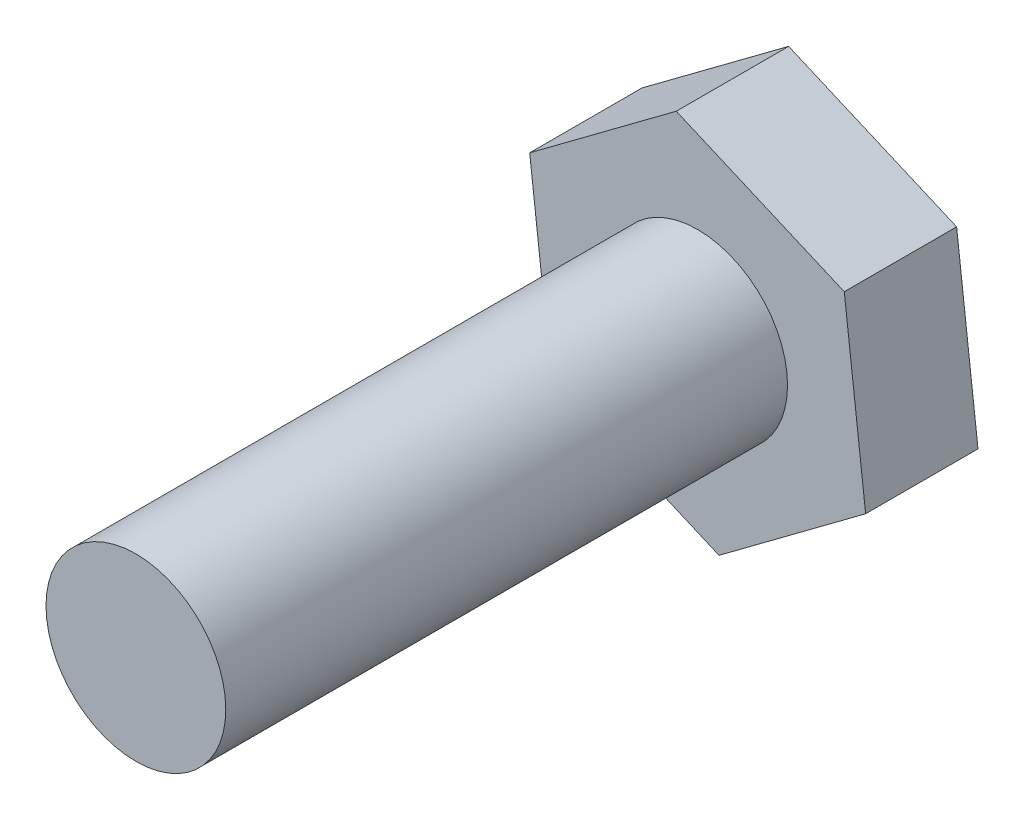
ISO-10303-21;
HEADER;
FILE_DESCRIPTION(('STEP AP214'),'2;1');
FILE_NAME('part.step','',(''),(''),'','','');
FILE_SCHEMA(('AUTOMOTIVE_DESIGN { 1 0 10303 214 1 1 1 1 }'));
ENDSEC;
DATA;
#1=APPLICATION_CONTEXT('core data for automotive mechanical design processes');
#2=APPLICATION_PROTOCOL_DEFINITION('international standard','automotive_design',2000,#1);
#3=PRODUCT_CONTEXT('',#1,'mechanical');
#4=PRODUCT('Part','Part','',(#3));
#5=PRODUCT_RELATED_PRODUCT_CATEGORY('part','',(#4));
#6=PRODUCT_DEFINITION_FORMATION('','',#4);
#7=PRODUCT_DEFINITION_CONTEXT('part definition',#1,'design');
#8=PRODUCT_DEFINITION('design','',#6,#7);
#9=PRODUCT_DEFINITION_SHAPE('','',#8);
#10=(LENGTH_UNIT() NAMED_UNIT(*) SI_UNIT(.MILLI.,.METRE.));
#11=(NAMED_UNIT(*) PLANE_ANGLE_UNIT() SI_UNIT($,.RADIAN.));
#12=(NAMED_UNIT(*) SI_UNIT($,.STERADIAN.) SOLID_ANGLE_UNIT());
#13=UNCERTAINTY_MEASURE_WITH_UNIT(LENGTH_MEASURE(1.E-05),#10,'distance_accuracy_value','');
#14=(GEOMETRIC_REPRESENTATION_CONTEXT(3) GLOBAL_UNCERTAINTY_ASSIGNED_CONTEXT((#13)) GLOBAL_UNIT_ASSIGNED_CONTEXT((#10,
#11,#12)) REPRESENTATION_CONTEXT('',''));
#15=CARTESIAN_POINT('',(0.,0.,0.));
#16=DIRECTION('',(0.,0.,1.));
#17=DIRECTION('',(1.,0.,0.));
#18=AXIS2_PLACEMENT_3D('',#15,#16,#17);
#19=CARTESIAN_POINT('',(6.52453507243205,4.86498129609213,5.));
#20=DIRECTION('',(-0.3953878135582,-0.918514276911179,0.));
#21=DIRECTION('',(0.918514276911179,-0.3953878135582,0.));
#22=AXIS2_PLACEMENT_3D('',#19,#20,#21);
#23=PLANE('',#22);
#24=DIRECTION('',(-0.918514276911179,0.3953878135582,0.));
#25=VECTOR('',#24,1.);
#26=CARTESIAN_POINT('',(6.52453507243205,4.86498129609213,0.));
#27=LINE('',#26,#25);
#28=CARTESIAN_POINT('',(6.52453507243205,4.86498129609213,0.));
#29=VERTEX_POINT('',#28);
#30=CARTESIAN_POINT('',(-0.950929855135908,8.08290376865476,0.));
#31=VERTEX_POINT('',#30);
#32=EDGE_CURVE('E117',#29,#31,#27,.T.);
#33=ORIENTED_EDGE('',*,*,#32,.T.);
#34=DIRECTION('',(0.,0.,-1.));
#35=VECTOR('',#34,1.);
#36=CARTESIAN_POINT('',(-0.950929855135908,8.08290376865476,5.));
#37=LINE('',#36,#35);
#38=CARTESIAN_POINT('',(-0.950929855135908,8.08290376865476,5.));
#39=VERTEX_POINT('',#38);
#40=EDGE_CURVE('E11',#39,#31,#37,.T.);
#41=ORIENTED_EDGE('',*,*,#40,.F.);
#42=DIRECTION('',(-0.918514276911179,0.3953878135582,0.));
#43=VECTOR('',#42,1.);
#44=CARTESIAN_POINT('',(6.52453507243205,4.86498129609213,5.));
#45=LINE('',#44,#43);
#46=CARTESIAN_POINT('',(6.52453507243205,4.86498129609213,5.));
#47=VERTEX_POINT('',#46);
#48=EDGE_CURVE('E128',#47,#39,#45,.T.);
#49=ORIENTED_EDGE('',*,*,#48,.F.);
#50=DIRECTION('',(0.,0.,-1.));
#51=VECTOR('',#50,1.);
#52=CARTESIAN_POINT('',(6.52453507243205,4.86498129609213,5.));
#53=LINE('',#52,#51);
#54=EDGE_CURVE('E113',#47,#29,#53,.T.);
#55=ORIENTED_EDGE('',*,*,#54,.T.);
#56=EDGE_LOOP('',(#33,#41,#49,#55));
#57=FACE_BOUND('',#56,.T.);
#58=ADVANCED_FACE('F33',(#57),#23,.F.);
#59=CARTESIAN_POINT('',(-0.950929855135908,8.08290376865476,5.));
#60=DIRECTION('',(0.597762790764676,-0.801673029343775,0.));
#61=DIRECTION('',(0.801673029343775,0.597762790764676,0.));
#62=AXIS2_PLACEMENT_3D('',#59,#60,#61);
#63=PLANE('',#62);
#64=DIRECTION('',(-0.801673029343775,-0.597762790764676,0.));
#65=VECTOR('',#64,1.);
#66=CARTESIAN_POINT('',(-0.950929855135908,8.08290376865476,0.));
#67=LINE('',#66,#65);
#68=CARTESIAN_POINT('',(-7.47546492756795,3.21792247256263,0.));
#69=VERTEX_POINT('',#68);
#70=EDGE_CURVE('E120',#31,#69,#67,.T.);
#71=ORIENTED_EDGE('',*,*,#70,.T.);
#72=DIRECTION('',(0.,0.,-1.));
#73=VECTOR('',#72,1.);
#74=CARTESIAN_POINT('',(-7.47546492756795,3.21792247256263,5.));
#75=LINE('',#74,#73);
#76=CARTESIAN_POINT('',(-7.47546492756795,3.21792247256263,5.));
#77=VERTEX_POINT('',#76);
#78=EDGE_CURVE('E41',#77,#69,#75,.T.);
#79=ORIENTED_EDGE('',*,*,#78,.F.);
#80=DIRECTION('',(-0.801673029343775,-0.597762790764676,0.));
#81=VECTOR('',#80,1.);
#82=CARTESIAN_POINT('',(-0.950929855135908,8.08290376865476,5.));
#83=LINE('',#82,#81);
#84=EDGE_CURVE('E86',#39,#77,#83,.T.);
#85=ORIENTED_EDGE('',*,*,#84,.F.);
#86=ORIENTED_EDGE('',*,*,#40,.T.);
#87=EDGE_LOOP('',(#71,#79,#85,#86));
#88=FACE_BOUND('',#87,.T.);
#89=ADVANCED_FACE('F153',(#88),#63,.F.);
#90=CARTESIAN_POINT('',(-7.47546492756795,3.21792247256263,5.));
#91=DIRECTION('',(0.993150604322875,0.116841247567403,0.));
#92=DIRECTION('',(-0.116841247567403,0.993150604322875,0.));
#93=AXIS2_PLACEMENT_3D('',#90,#91,#92);
#94=PLANE('',#93);
#95=DIRECTION('',(0.116841247567403,-0.993150604322875,0.));
#96=VECTOR('',#95,1.);
#97=CARTESIAN_POINT('',(-7.47546492756795,3.21792247256263,0.));
#98=LINE('',#97,#96);
#99=CARTESIAN_POINT('',(-6.52453507243205,-4.86498129609213,0.));
#100=VERTEX_POINT('',#99);
#101=EDGE_CURVE('E123',#69,#100,#98,.T.);
#102=ORIENTED_EDGE('',*,*,#101,.T.);
#103=DIRECTION('',(0.,0.,-1.));
#104=VECTOR('',#103,1.);
#105=CARTESIAN_POINT('',(-6.52453507243205,-4.86498129609213,5.));
#106=LINE('',#105,#104);
#107=CARTESIAN_POINT('',(-6.52453507243205,-4.86498129609213,5.));
#108=VERTEX_POINT('',#107);
#109=EDGE_CURVE('E108',#108,#100,#106,.T.);
#110=ORIENTED_EDGE('',*,*,#109,.F.);
#111=DIRECTION('',(0.116841247567403,-0.993150604322875,0.));
#112=VECTOR('',#111,1.);
#113=CARTESIAN_POINT('',(-7.47546492756795,3.21792247256263,5.));
#114=LINE('',#113,#112);
#115=EDGE_CURVE('E99',#77,#108,#114,.T.);
#116=ORIENTED_EDGE('',*,*,#115,.F.);
#117=ORIENTED_EDGE('',*,*,#78,.T.);
#118=EDGE_LOOP('',(#102,#110,#116,#117));
#119=FACE_BOUND('',#118,.T.);
#120=ADVANCED_FACE('F134',(#119),#94,.F.);
#121=CARTESIAN_POINT('',(-6.52453507243205,-4.86498129609213,5.));
#122=DIRECTION('',(0.3953878135582,0.918514276911179,0.));
#123=DIRECTION('',(-0.918514276911179,0.3953878135582,0.));
#124=AXIS2_PLACEMENT_3D('',#121,#122,#123);
#125=PLANE('',#124);
#126=DIRECTION('',(0.918514276911179,-0.3953878135582,0.));
#127=VECTOR('',#126,1.);
#128=CARTESIAN_POINT('',(-6.52453507243205,-4.86498129609213,0.));
#129=LINE('',#128,#127);
#130=CARTESIAN_POINT('',(0.950929855135903,-8.08290376865476,0.));
#131=VERTEX_POINT('',#130);
#132=EDGE_CURVE('E107',#100,#131,#129,.T.);
#133=ORIENTED_EDGE('',*,*,#132,.T.);
#134=DIRECTION('',(0.,0.,-1.));
#135=VECTOR('',#134,1.);
#136=CARTESIAN_POINT('',(0.950929855135903,-8.08290376865476,5.));
#137=LINE('',#136,#135);
#138=CARTESIAN_POINT('',(0.950929855135903,-8.08290376865476,5.));
#139=VERTEX_POINT('',#138);
#140=EDGE_CURVE('E104',#139,#131,#137,.T.);
#141=ORIENTED_EDGE('',*,*,#140,.F.);
#142=DIRECTION('',(0.918514276911179,-0.3953878135582,0.));
#143=VECTOR('',#142,1.);
#144=CARTESIAN_POINT('',(-6.52453507243205,-4.86498129609213,5.));
#145=LINE('',#144,#143);
#146=EDGE_CURVE('E93',#108,#139,#145,.T.);
#147=ORIENTED_EDGE('',*,*,#146,.F.);
#148=ORIENTED_EDGE('',*,*,#109,.T.);
#149=EDGE_LOOP('',(#133,#141,#147,#148));
#150=FACE_BOUND('',#149,.T.);
#151=ADVANCED_FACE('F105',(#150),#125,.F.);
#152=CARTESIAN_POINT('',(0.950929855135903,-8.08290376865476,5.));
#153=DIRECTION('',(-0.597762790764676,0.801673029343776,0.));
#154=DIRECTION('',(-0.801673029343776,-0.597762790764676,0.));
#155=AXIS2_PLACEMENT_3D('',#152,#153,#154);
#156=PLANE('',#155);
#157=DIRECTION('',(0.801673029343776,0.597762790764676,0.));
#158=VECTOR('',#157,1.);
#159=CARTESIAN_POINT('',(0.950929855135903,-8.08290376865476,0.));
#160=LINE('',#159,#158);
#161=CARTESIAN_POINT('',(7.47546492756795,-3.21792247256263,0.));
#162=VERTEX_POINT('',#161);
#163=EDGE_CURVE('E72',#131,#162,#160,.T.);
#164=ORIENTED_EDGE('',*,*,#163,.T.);
#165=DIRECTION('',(0.,0.,-1.));
#166=VECTOR('',#165,1.);
#167=CARTESIAN_POINT('',(7.47546492756795,-3.21792247256263,5.));
#168=LINE('',#167,#166);
#169=CARTESIAN_POINT('',(7.47546492756795,-3.21792247256263,5.));
#170=VERTEX_POINT('',#169);
#171=EDGE_CURVE('E109',#170,#162,#168,.T.);
#172=ORIENTED_EDGE('',*,*,#171,.F.);
#173=DIRECTION('',(0.801673029343776,0.597762790764676,0.));
#174=VECTOR('',#173,1.);
#175=CARTESIAN_POINT('',(0.950929855135903,-8.08290376865476,5.));
#176=LINE('',#175,#174);
#177=EDGE_CURVE('E97',#139,#170,#176,.T.);
#178=ORIENTED_EDGE('',*,*,#177,.F.);
#179=ORIENTED_EDGE('',*,*,#140,.T.);
#180=EDGE_LOOP('',(#164,#172,#178,#179));
#181=FACE_BOUND('',#180,.T.);
#182=ADVANCED_FACE('F111',(#181),#156,.F.);
#183=CARTESIAN_POINT('',(7.47546492756795,-3.21792247256263,5.));
#184=DIRECTION('',(-0.993150604322875,-0.116841247567403,0.));
#185=DIRECTION('',(0.116841247567403,-0.993150604322875,0.));
#186=AXIS2_PLACEMENT_3D('',#183,#184,#185);
#187=PLANE('',#186);
#188=DIRECTION('',(-0.116841247567403,0.993150604322875,0.));
#189=VECTOR('',#188,1.);
#190=CARTESIAN_POINT('',(7.47546492756795,-3.21792247256263,0.));
#191=LINE('',#190,#189);
#192=EDGE_CURVE('E78',#162,#29,#191,.T.);
#193=ORIENTED_EDGE('',*,*,#192,.T.);
#194=ORIENTED_EDGE('',*,*,#54,.F.);
#195=DIRECTION('',(-0.116841247567403,0.993150604322875,0.));
#196=VECTOR('',#195,1.);
#197=CARTESIAN_POINT('',(7.47546492756795,-3.21792247256263,5.));
#198=LINE('',#197,#196);
#199=EDGE_CURVE('E49',#170,#47,#198,.T.);
#200=ORIENTED_EDGE('',*,*,#199,.F.);
#201=ORIENTED_EDGE('',*,*,#171,.T.);
#202=EDGE_LOOP('',(#193,#194,#200,#201));
#203=FACE_BOUND('',#202,.T.);
#204=ADVANCED_FACE('F141',(#203),#187,.F.);
#205=CARTESIAN_POINT('',(0.,0.,5.));
#206=DIRECTION('',(0.,0.,1.));
#207=DIRECTION('',(1.,0.,0.));
#208=AXIS2_PLACEMENT_3D('',#205,#206,#207);
#209=PLANE('',#208);
#210=CARTESIAN_POINT('',(0.,0.,5.));
#211=DIRECTION('',(0.,0.,1.));
#212=DIRECTION('',(1.,0.,0.));
#213=AXIS2_PLACEMENT_3D('',#210,#211,#212);
#214=CIRCLE('',#213,4.);
#215=CARTESIAN_POINT('',(4.,0.,5.));
#216=VERTEX_POINT('',#215);
#217=EDGE_CURVE('E214',#216,#216,#214,.T.);
#218=ORIENTED_EDGE('',*,*,#217,.F.);
#219=EDGE_LOOP('',(#218));
#220=FACE_BOUND('',#219,.T.);
#221=ORIENTED_EDGE('',*,*,#48,.T.);
#222=ORIENTED_EDGE('',*,*,#84,.T.);
#223=ORIENTED_EDGE('',*,*,#115,.T.);
#224=ORIENTED_EDGE('',*,*,#146,.T.);
#225=ORIENTED_EDGE('',*,*,#177,.T.);
#226=ORIENTED_EDGE('',*,*,#199,.T.);
#227=EDGE_LOOP('',(#221,#222,#223,#224,#225,#226));
#228=FACE_BOUND('',#227,.T.);
#229=ADVANCED_FACE('F95',(#220,#228),#209,.T.);
#230=CARTESIAN_POINT('',(0.,0.,0.));
#231=DIRECTION('',(0.,0.,1.));
#232=DIRECTION('',(1.,0.,0.));
#233=AXIS2_PLACEMENT_3D('',#230,#231,#232);
#234=PLANE('',#233);
#235=ORIENTED_EDGE('',*,*,#32,.F.);
#236=ORIENTED_EDGE('',*,*,#192,.F.);
#237=ORIENTED_EDGE('',*,*,#163,.F.);
#238=ORIENTED_EDGE('',*,*,#132,.F.);
#239=ORIENTED_EDGE('',*,*,#101,.F.);
#240=ORIENTED_EDGE('',*,*,#70,.F.);
#241=EDGE_LOOP('',(#235,#236,#237,#238,#239,#240));
#242=FACE_BOUND('',#241,.T.);
#243=ADVANCED_FACE('F137',(#242),#234,.F.);
#244=CARTESIAN_POINT('',(0.,0.,30.));
#245=DIRECTION('',(0.,0.,-1.));
#246=DIRECTION('',(-1.,0.,0.));
#247=AXIS2_PLACEMENT_3D('',#244,#245,#246);
#248=CYLINDRICAL_SURFACE('',#247,4.);
#249=CARTESIAN_POINT('',(0.,0.,30.));
#250=DIRECTION('',(0.,0.,1.));
#251=DIRECTION('',(1.,0.,0.));
#252=AXIS2_PLACEMENT_3D('',#249,#250,#251);
#253=CIRCLE('',#252,4.);
#254=CARTESIAN_POINT('',(4.,0.,30.));
#255=VERTEX_POINT('',#254);
#256=EDGE_CURVE('E121',#255,#255,#253,.T.);
#257=ORIENTED_EDGE('',*,*,#256,.F.);
#258=EDGE_LOOP('',(#257));
#259=FACE_BOUND('',#258,.T.);
#260=ORIENTED_EDGE('',*,*,#217,.T.);
#261=EDGE_LOOP('',(#260));
#262=FACE_BOUND('',#261,.T.);
#263=ADVANCED_FACE('F185',(#259,#262),#248,.T.);
#264=CARTESIAN_POINT('',(0.,0.,30.));
#265=DIRECTION('',(0.,0.,1.));
#266=DIRECTION('',(1.,0.,0.));
#267=AXIS2_PLACEMENT_3D('',#264,#265,#266);
#268=PLANE('',#267);
#269=ORIENTED_EDGE('',*,*,#256,.T.);
#270=EDGE_LOOP('',(#269));
#271=FACE_BOUND('',#270,.T.);
#272=ADVANCED_FACE('F198',(#271),#268,.T.);
#273=CLOSED_SHELL('',(#58,#89,#120,#151,#182,#204,#229,#243,#263,#272));
#274=MANIFOLD_SOLID_BREP('B2',#273);
#275=ADVANCED_BREP_SHAPE_REPRESENTATION('',(#18,#274),#14);
#276=SHAPE_DEFINITION_REPRESENTATION(#9,#275);
ENDSEC;
END-ISO-10303-21;
